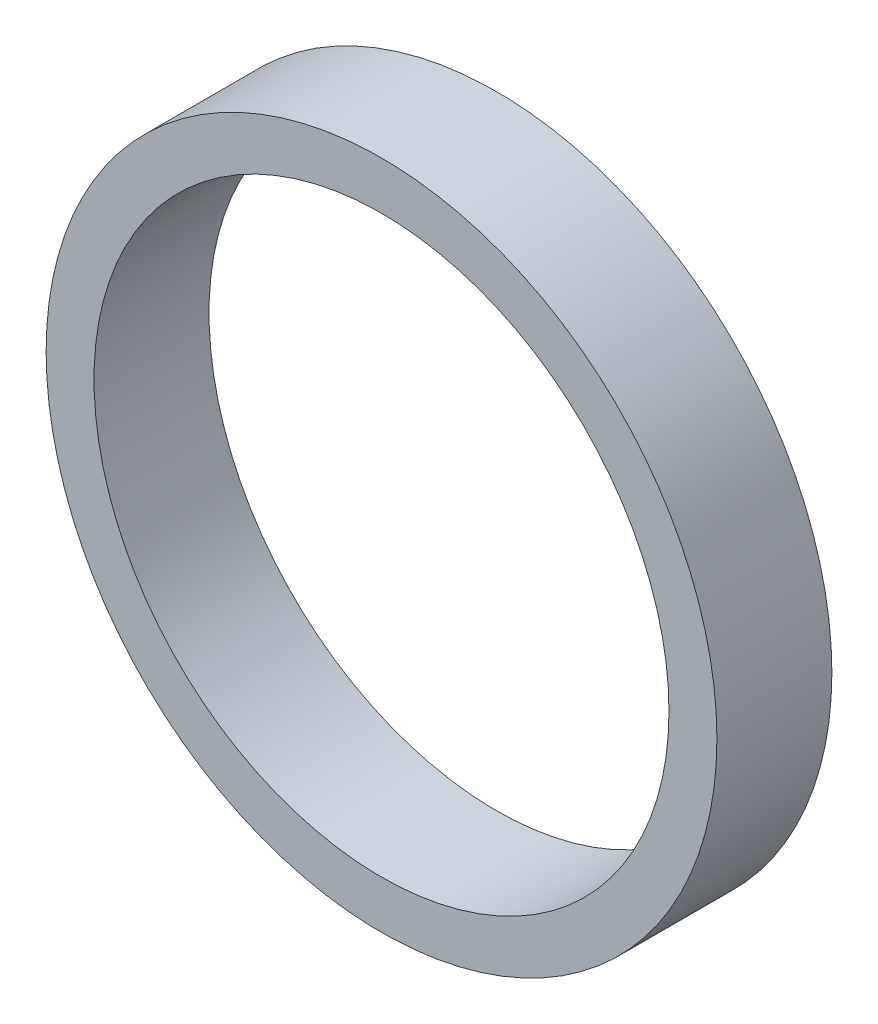
ISO-10303-21;
HEADER;
FILE_DESCRIPTION(('STEP AP214'),'2;1');
FILE_NAME('part.step','',(''),(''),'','','');
FILE_SCHEMA(('AUTOMOTIVE_DESIGN { 1 0 10303 214 1 1 1 1 }'));
ENDSEC;
DATA;
#1=APPLICATION_CONTEXT('core data for automotive mechanical design processes');
#2=APPLICATION_PROTOCOL_DEFINITION('international standard','automotive_design',2000,#1);
#3=PRODUCT_CONTEXT('',#1,'mechanical');
#4=PRODUCT('Part','Part','',(#3));
#5=PRODUCT_RELATED_PRODUCT_CATEGORY('part','',(#4));
#6=PRODUCT_DEFINITION_FORMATION('','',#4);
#7=PRODUCT_DEFINITION_CONTEXT('part definition',#1,'design');
#8=PRODUCT_DEFINITION('design','',#6,#7);
#9=PRODUCT_DEFINITION_SHAPE('','',#8);
#10=(LENGTH_UNIT() NAMED_UNIT(*) SI_UNIT(.MILLI.,.METRE.));
#11=(NAMED_UNIT(*) PLANE_ANGLE_UNIT() SI_UNIT($,.RADIAN.));
#12=(NAMED_UNIT(*) SI_UNIT($,.STERADIAN.) SOLID_ANGLE_UNIT());
#13=UNCERTAINTY_MEASURE_WITH_UNIT(LENGTH_MEASURE(1.E-05),#10,'distance_accuracy_value','');
#14=(GEOMETRIC_REPRESENTATION_CONTEXT(3) GLOBAL_UNCERTAINTY_ASSIGNED_CONTEXT((#13)) GLOBAL_UNIT_ASSIGNED_CONTEXT((#10,
#11,#12)) REPRESENTATION_CONTEXT('',''));
#15=CARTESIAN_POINT('',(0.,0.,0.));
#16=DIRECTION('',(0.,0.,1.));
#17=DIRECTION('',(1.,0.,0.));
#18=AXIS2_PLACEMENT_3D('',#15,#16,#17);
#19=CARTESIAN_POINT('',(0.,0.,6.));
#20=DIRECTION('',(0.,0.,1.));
#21=DIRECTION('',(1.,0.,0.));
#22=AXIS2_PLACEMENT_3D('',#19,#20,#21);
#23=PLANE('',#22);
#24=CARTESIAN_POINT('',(0.,0.,6.));
#25=DIRECTION('',(0.,0.,1.));
#26=DIRECTION('',(1.,0.,0.));
#27=AXIS2_PLACEMENT_3D('',#24,#25,#26);
#28=CIRCLE('',#27,17.5);
#29=CARTESIAN_POINT('',(17.5,0.,6.));
#30=VERTEX_POINT('',#29);
#31=EDGE_CURVE('E10',#30,#30,#28,.T.);
#32=ORIENTED_EDGE('',*,*,#31,.T.);
#33=EDGE_LOOP('',(#32));
#34=FACE_BOUND('',#33,.T.);
#35=CARTESIAN_POINT('',(0.,0.,6.));
#36=DIRECTION('',(0.,0.,1.));
#37=DIRECTION('',(1.,0.,0.));
#38=AXIS2_PLACEMENT_3D('',#35,#36,#37);
#39=CIRCLE('',#38,15.);
#40=CARTESIAN_POINT('',(15.,0.,6.));
#41=VERTEX_POINT('',#40);
#42=EDGE_CURVE('E41',#41,#41,#39,.T.);
#43=ORIENTED_EDGE('',*,*,#42,.F.);
#44=EDGE_LOOP('',(#43));
#45=FACE_BOUND('',#44,.T.);
#46=ADVANCED_FACE('F30',(#34,#45),#23,.T.);
#47=CARTESIAN_POINT('',(0.,0.,0.));
#48=DIRECTION('',(0.,0.,1.));
#49=DIRECTION('',(1.,0.,0.));
#50=AXIS2_PLACEMENT_3D('',#47,#48,#49);
#51=PLANE('',#50);
#52=CARTESIAN_POINT('',(0.,0.,0.));
#53=DIRECTION('',(0.,0.,1.));
#54=DIRECTION('',(1.,0.,0.));
#55=AXIS2_PLACEMENT_3D('',#52,#53,#54);
#56=CIRCLE('',#55,17.5);
#57=CARTESIAN_POINT('',(17.5,0.,0.));
#58=VERTEX_POINT('',#57);
#59=EDGE_CURVE('E34',#58,#58,#56,.T.);
#60=ORIENTED_EDGE('',*,*,#59,.F.);
#61=EDGE_LOOP('',(#60));
#62=FACE_BOUND('',#61,.T.);
#63=CARTESIAN_POINT('',(0.,0.,0.));
#64=DIRECTION('',(0.,0.,1.));
#65=DIRECTION('',(1.,0.,0.));
#66=AXIS2_PLACEMENT_3D('',#63,#64,#65);
#67=CIRCLE('',#66,15.);
#68=CARTESIAN_POINT('',(15.,0.,0.));
#69=VERTEX_POINT('',#68);
#70=EDGE_CURVE('E43',#69,#69,#67,.T.);
#71=ORIENTED_EDGE('',*,*,#70,.T.);
#72=EDGE_LOOP('',(#71));
#73=FACE_BOUND('',#72,.T.);
#74=ADVANCED_FACE('F53',(#62,#73),#51,.F.);
#75=CARTESIAN_POINT('',(0.,0.,6.));
#76=DIRECTION('',(0.,0.,-1.));
#77=DIRECTION('',(-1.,0.,0.));
#78=AXIS2_PLACEMENT_3D('',#75,#76,#77);
#79=CYLINDRICAL_SURFACE('',#78,17.5);
#80=ORIENTED_EDGE('',*,*,#31,.F.);
#81=EDGE_LOOP('',(#80));
#82=FACE_BOUND('',#81,.T.);
#83=ORIENTED_EDGE('',*,*,#59,.T.);
#84=EDGE_LOOP('',(#83));
#85=FACE_BOUND('',#84,.T.);
#86=ADVANCED_FACE('F32',(#82,#85),#79,.T.);
#87=CARTESIAN_POINT('',(0.,0.,6.));
#88=DIRECTION('',(0.,0.,-1.));
#89=DIRECTION('',(-1.,0.,0.));
#90=AXIS2_PLACEMENT_3D('',#87,#88,#89);
#91=CYLINDRICAL_SURFACE('',#90,15.);
#92=ORIENTED_EDGE('',*,*,#42,.T.);
#93=EDGE_LOOP('',(#92));
#94=FACE_BOUND('',#93,.T.);
#95=ORIENTED_EDGE('',*,*,#70,.F.);
#96=EDGE_LOOP('',(#95));
#97=FACE_BOUND('',#96,.T.);
#98=ADVANCED_FACE('F49',(#94,#97),#91,.F.);
#99=CLOSED_SHELL('',(#46,#74,#86,#98));
#100=MANIFOLD_SOLID_BREP('B2',#99);
#101=ADVANCED_BREP_SHAPE_REPRESENTATION('',(#18,#100),#14);
#102=SHAPE_DEFINITION_REPRESENTATION(#9,#101);
ENDSEC;
END-ISO-10303-21;
